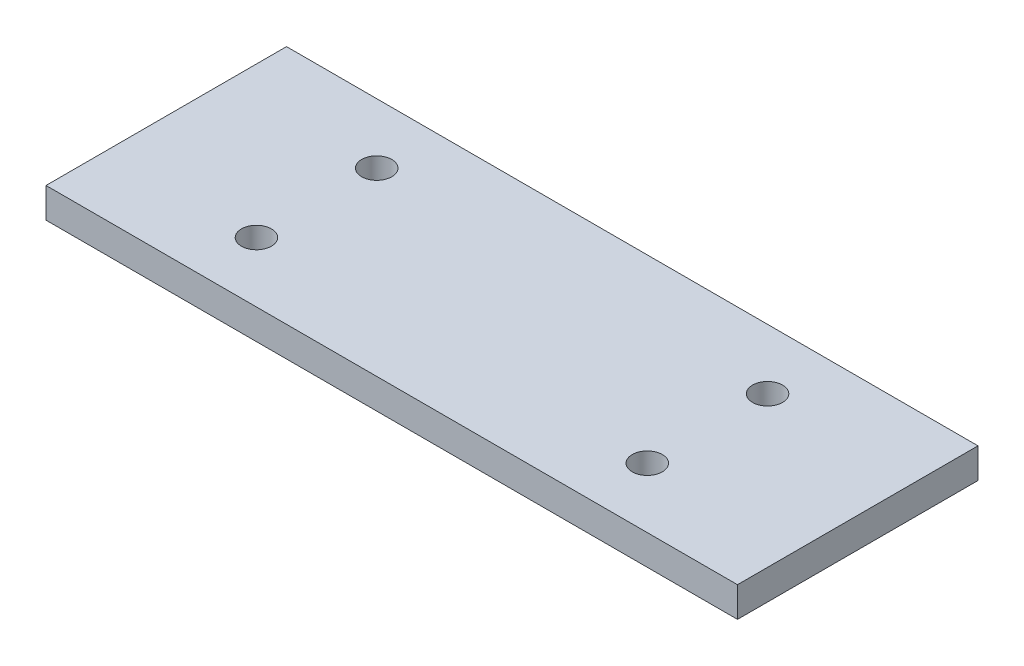
ISO-10303-21;
HEADER;
FILE_DESCRIPTION(('STEP AP214'),'2;1');
FILE_NAME('part.step','',(''),(''),'','','');
FILE_SCHEMA(('AUTOMOTIVE_DESIGN { 1 0 10303 214 1 1 1 1 }'));
ENDSEC;
DATA;
#1=APPLICATION_CONTEXT('core data for automotive mechanical design processes');
#2=APPLICATION_PROTOCOL_DEFINITION('international standard','automotive_design',2000,#1);
#3=PRODUCT_CONTEXT('',#1,'mechanical');
#4=PRODUCT('Part','Part','',(#3));
#5=PRODUCT_RELATED_PRODUCT_CATEGORY('part','',(#4));
#6=PRODUCT_DEFINITION_FORMATION('','',#4);
#7=PRODUCT_DEFINITION_CONTEXT('part definition',#1,'design');
#8=PRODUCT_DEFINITION('design','',#6,#7);
#9=PRODUCT_DEFINITION_SHAPE('','',#8);
#10=(LENGTH_UNIT() NAMED_UNIT(*) SI_UNIT(.MILLI.,.METRE.));
#11=(NAMED_UNIT(*) PLANE_ANGLE_UNIT() SI_UNIT($,.RADIAN.));
#12=(NAMED_UNIT(*) SI_UNIT($,.STERADIAN.) SOLID_ANGLE_UNIT());
#13=UNCERTAINTY_MEASURE_WITH_UNIT(LENGTH_MEASURE(1.E-05),#10,'distance_accuracy_value','');
#14=(GEOMETRIC_REPRESENTATION_CONTEXT(3) GLOBAL_UNCERTAINTY_ASSIGNED_CONTEXT((#13)) GLOBAL_UNIT_ASSIGNED_CONTEXT((#10,
#11,#12)) REPRESENTATION_CONTEXT('',''));
#15=CARTESIAN_POINT('',(0.,0.,0.));
#16=DIRECTION('',(0.,0.,1.));
#17=DIRECTION('',(1.,0.,0.));
#18=AXIS2_PLACEMENT_3D('',#15,#16,#17);
#19=CARTESIAN_POINT('',(0.,5.,0.));
#20=DIRECTION('',(0.,-1.,0.));
#21=DIRECTION('',(0.,0.,-1.));
#22=AXIS2_PLACEMENT_3D('',#19,#20,#21);
#23=PLANE('',#22);
#24=DIRECTION('',(0.,0.,1.));
#25=VECTOR('',#24,1.);
#26=CARTESIAN_POINT('',(0.,5.,0.));
#27=LINE('',#26,#25);
#28=CARTESIAN_POINT('',(0.,5.,-40.));
#29=VERTEX_POINT('',#28);
#30=CARTESIAN_POINT('',(0.,5.,0.));
#31=VERTEX_POINT('',#30);
#32=EDGE_CURVE('E89',#29,#31,#27,.T.);
#33=ORIENTED_EDGE('',*,*,#32,.T.);
#34=DIRECTION('',(1.,0.,0.));
#35=VECTOR('',#34,1.);
#36=CARTESIAN_POINT('',(0.,5.,0.));
#37=LINE('',#36,#35);
#38=CARTESIAN_POINT('',(115.,5.,0.));
#39=VERTEX_POINT('',#38);
#40=EDGE_CURVE('E84',#31,#39,#37,.T.);
#41=ORIENTED_EDGE('',*,*,#40,.T.);
#42=DIRECTION('',(0.,0.,-1.));
#43=VECTOR('',#42,1.);
#44=CARTESIAN_POINT('',(115.,5.,0.));
#45=LINE('',#44,#43);
#46=CARTESIAN_POINT('',(115.,5.,-40.));
#47=VERTEX_POINT('',#46);
#48=EDGE_CURVE('E87',#39,#47,#45,.T.);
#49=ORIENTED_EDGE('',*,*,#48,.T.);
#50=DIRECTION('',(-1.,0.,0.));
#51=VECTOR('',#50,1.);
#52=CARTESIAN_POINT('',(0.,5.,-40.));
#53=LINE('',#52,#51);
#54=EDGE_CURVE('E54',#47,#29,#53,.T.);
#55=ORIENTED_EDGE('',*,*,#54,.T.);
#56=EDGE_LOOP('',(#33,#41,#49,#55));
#57=FACE_BOUND('',#56,.T.);
#58=CARTESIAN_POINT('',(25.,5.,-30.));
#59=DIRECTION('',(0.,1.,0.));
#60=DIRECTION('',(0.,0.,1.));
#61=AXIS2_PLACEMENT_3D('',#58,#59,#60);
#62=CIRCLE('',#61,2.5);
#63=CARTESIAN_POINT('',(25.,5.,-27.5));
#64=VERTEX_POINT('',#63);
#65=EDGE_CURVE('E104',#64,#64,#62,.T.);
#66=ORIENTED_EDGE('',*,*,#65,.F.);
#67=EDGE_LOOP('',(#66));
#68=FACE_BOUND('',#67,.T.);
#69=CARTESIAN_POINT('',(25.,5.,-10.));
#70=DIRECTION('',(0.,1.,0.));
#71=DIRECTION('',(0.,0.,1.));
#72=AXIS2_PLACEMENT_3D('',#69,#70,#71);
#73=CIRCLE('',#72,2.5);
#74=CARTESIAN_POINT('',(25.,5.,-7.5));
#75=VERTEX_POINT('',#74);
#76=EDGE_CURVE('E119',#75,#75,#73,.T.);
#77=ORIENTED_EDGE('',*,*,#76,.F.);
#78=EDGE_LOOP('',(#77));
#79=FACE_BOUND('',#78,.T.);
#80=CARTESIAN_POINT('',(90.,5.,-10.));
#81=DIRECTION('',(0.,1.,0.));
#82=DIRECTION('',(0.,0.,-1.));
#83=AXIS2_PLACEMENT_3D('',#80,#81,#82);
#84=CIRCLE('',#83,2.5);
#85=CARTESIAN_POINT('',(90.,5.,-12.5));
#86=VERTEX_POINT('',#85);
#87=EDGE_CURVE('E125',#86,#86,#84,.T.);
#88=ORIENTED_EDGE('',*,*,#87,.F.);
#89=EDGE_LOOP('',(#88));
#90=FACE_BOUND('',#89,.T.);
#91=CARTESIAN_POINT('',(90.,5.,-30.));
#92=DIRECTION('',(0.,1.,0.));
#93=DIRECTION('',(0.,0.,-1.));
#94=AXIS2_PLACEMENT_3D('',#91,#92,#93);
#95=CIRCLE('',#94,2.49999999999999);
#96=CARTESIAN_POINT('',(90.,5.,-32.5));
#97=VERTEX_POINT('',#96);
#98=EDGE_CURVE('E131',#97,#97,#95,.T.);
#99=ORIENTED_EDGE('',*,*,#98,.F.);
#100=EDGE_LOOP('',(#99));
#101=FACE_BOUND('',#100,.T.);
#102=ADVANCED_FACE('F37',(#57,#68,#79,#90,#101),#23,.F.);
#103=CARTESIAN_POINT('',(0.,0.,0.));
#104=DIRECTION('',(0.,-1.,0.));
#105=DIRECTION('',(0.,0.,-1.));
#106=AXIS2_PLACEMENT_3D('',#103,#104,#105);
#107=PLANE('',#106);
#108=CARTESIAN_POINT('',(90.,0.,-10.));
#109=DIRECTION('',(0.,1.,0.));
#110=DIRECTION('',(0.,0.,-1.));
#111=AXIS2_PLACEMENT_3D('',#108,#109,#110);
#112=CIRCLE('',#111,2.5);
#113=CARTESIAN_POINT('',(90.,0.,-12.5));
#114=VERTEX_POINT('',#113);
#115=EDGE_CURVE('E128',#114,#114,#112,.T.);
#116=ORIENTED_EDGE('',*,*,#115,.T.);
#117=EDGE_LOOP('',(#116));
#118=FACE_BOUND('',#117,.T.);
#119=CARTESIAN_POINT('',(25.,0.,-30.));
#120=DIRECTION('',(0.,1.,0.));
#121=DIRECTION('',(0.,0.,1.));
#122=AXIS2_PLACEMENT_3D('',#119,#120,#121);
#123=CIRCLE('',#122,2.5);
#124=CARTESIAN_POINT('',(25.,0.,-27.5));
#125=VERTEX_POINT('',#124);
#126=EDGE_CURVE('E116',#125,#125,#123,.T.);
#127=ORIENTED_EDGE('',*,*,#126,.T.);
#128=EDGE_LOOP('',(#127));
#129=FACE_BOUND('',#128,.T.);
#130=DIRECTION('',(0.,0.,1.));
#131=VECTOR('',#130,1.);
#132=CARTESIAN_POINT('',(0.,0.,0.));
#133=LINE('',#132,#131);
#134=CARTESIAN_POINT('',(0.,0.,-40.));
#135=VERTEX_POINT('',#134);
#136=CARTESIAN_POINT('',(0.,0.,0.));
#137=VERTEX_POINT('',#136);
#138=EDGE_CURVE('E101',#135,#137,#133,.T.);
#139=ORIENTED_EDGE('',*,*,#138,.F.);
#140=DIRECTION('',(-1.,0.,0.));
#141=VECTOR('',#140,1.);
#142=CARTESIAN_POINT('',(0.,0.,-40.));
#143=LINE('',#142,#141);
#144=CARTESIAN_POINT('',(115.,0.,-40.));
#145=VERTEX_POINT('',#144);
#146=EDGE_CURVE('E77',#145,#135,#143,.T.);
#147=ORIENTED_EDGE('',*,*,#146,.F.);
#148=DIRECTION('',(0.,0.,-1.));
#149=VECTOR('',#148,1.);
#150=CARTESIAN_POINT('',(115.,0.,0.));
#151=LINE('',#150,#149);
#152=CARTESIAN_POINT('',(115.,0.,0.));
#153=VERTEX_POINT('',#152);
#154=EDGE_CURVE('E71',#153,#145,#151,.T.);
#155=ORIENTED_EDGE('',*,*,#154,.F.);
#156=DIRECTION('',(1.,0.,0.));
#157=VECTOR('',#156,1.);
#158=CARTESIAN_POINT('',(0.,0.,0.));
#159=LINE('',#158,#157);
#160=EDGE_CURVE('E93',#137,#153,#159,.T.);
#161=ORIENTED_EDGE('',*,*,#160,.F.);
#162=EDGE_LOOP('',(#139,#147,#155,#161));
#163=FACE_BOUND('',#162,.T.);
#164=CARTESIAN_POINT('',(25.,0.,-10.));
#165=DIRECTION('',(0.,1.,0.));
#166=DIRECTION('',(0.,0.,1.));
#167=AXIS2_PLACEMENT_3D('',#164,#165,#166);
#168=CIRCLE('',#167,2.5);
#169=CARTESIAN_POINT('',(25.,0.,-7.5));
#170=VERTEX_POINT('',#169);
#171=EDGE_CURVE('E122',#170,#170,#168,.T.);
#172=ORIENTED_EDGE('',*,*,#171,.T.);
#173=EDGE_LOOP('',(#172));
#174=FACE_BOUND('',#173,.T.);
#175=CARTESIAN_POINT('',(90.,0.,-30.));
#176=DIRECTION('',(0.,1.,0.));
#177=DIRECTION('',(0.,0.,-1.));
#178=AXIS2_PLACEMENT_3D('',#175,#176,#177);
#179=CIRCLE('',#178,2.49999999999999);
#180=CARTESIAN_POINT('',(90.,0.,-32.5));
#181=VERTEX_POINT('',#180);
#182=EDGE_CURVE('E134',#181,#181,#179,.T.);
#183=ORIENTED_EDGE('',*,*,#182,.T.);
#184=EDGE_LOOP('',(#183));
#185=FACE_BOUND('',#184,.T.);
#186=ADVANCED_FACE('F112',(#118,#129,#163,#174,#185),#107,.T.);
#187=CARTESIAN_POINT('',(0.,5.,0.));
#188=DIRECTION('',(1.,0.,0.));
#189=DIRECTION('',(0.,0.,-1.));
#190=AXIS2_PLACEMENT_3D('',#187,#188,#189);
#191=PLANE('',#190);
#192=ORIENTED_EDGE('',*,*,#138,.T.);
#193=DIRECTION('',(0.,-1.,0.));
#194=VECTOR('',#193,1.);
#195=CARTESIAN_POINT('',(0.,5.,0.));
#196=LINE('',#195,#194);
#197=EDGE_CURVE('E11',#31,#137,#196,.T.);
#198=ORIENTED_EDGE('',*,*,#197,.F.);
#199=ORIENTED_EDGE('',*,*,#32,.F.);
#200=DIRECTION('',(0.,-1.,0.));
#201=VECTOR('',#200,1.);
#202=CARTESIAN_POINT('',(0.,5.,-40.));
#203=LINE('',#202,#201);
#204=EDGE_CURVE('E97',#29,#135,#203,.T.);
#205=ORIENTED_EDGE('',*,*,#204,.T.);
#206=EDGE_LOOP('',(#192,#198,#199,#205));
#207=FACE_BOUND('',#206,.T.);
#208=ADVANCED_FACE('F39',(#207),#191,.F.);
#209=CARTESIAN_POINT('',(0.,5.,0.));
#210=DIRECTION('',(0.,0.,-1.));
#211=DIRECTION('',(-1.,0.,0.));
#212=AXIS2_PLACEMENT_3D('',#209,#210,#211);
#213=PLANE('',#212);
#214=ORIENTED_EDGE('',*,*,#160,.T.);
#215=DIRECTION('',(0.,-1.,0.));
#216=VECTOR('',#215,1.);
#217=CARTESIAN_POINT('',(115.,5.,0.));
#218=LINE('',#217,#216);
#219=EDGE_CURVE('E46',#39,#153,#218,.T.);
#220=ORIENTED_EDGE('',*,*,#219,.F.);
#221=ORIENTED_EDGE('',*,*,#40,.F.);
#222=ORIENTED_EDGE('',*,*,#197,.T.);
#223=EDGE_LOOP('',(#214,#220,#221,#222));
#224=FACE_BOUND('',#223,.T.);
#225=ADVANCED_FACE('F92',(#224),#213,.F.);
#226=CARTESIAN_POINT('',(115.,5.,0.));
#227=DIRECTION('',(-1.,0.,0.));
#228=DIRECTION('',(0.,0.,1.));
#229=AXIS2_PLACEMENT_3D('',#226,#227,#228);
#230=PLANE('',#229);
#231=ORIENTED_EDGE('',*,*,#154,.T.);
#232=DIRECTION('',(0.,-1.,0.));
#233=VECTOR('',#232,1.);
#234=CARTESIAN_POINT('',(115.,5.,-40.));
#235=LINE('',#234,#233);
#236=EDGE_CURVE('E94',#47,#145,#235,.T.);
#237=ORIENTED_EDGE('',*,*,#236,.F.);
#238=ORIENTED_EDGE('',*,*,#48,.F.);
#239=ORIENTED_EDGE('',*,*,#219,.T.);
#240=EDGE_LOOP('',(#231,#237,#238,#239));
#241=FACE_BOUND('',#240,.T.);
#242=ADVANCED_FACE('F95',(#241),#230,.F.);
#243=CARTESIAN_POINT('',(0.,5.,-40.));
#244=DIRECTION('',(0.,0.,1.));
#245=DIRECTION('',(1.,0.,0.));
#246=AXIS2_PLACEMENT_3D('',#243,#244,#245);
#247=PLANE('',#246);
#248=ORIENTED_EDGE('',*,*,#146,.T.);
#249=ORIENTED_EDGE('',*,*,#204,.F.);
#250=ORIENTED_EDGE('',*,*,#54,.F.);
#251=ORIENTED_EDGE('',*,*,#236,.T.);
#252=EDGE_LOOP('',(#248,#249,#250,#251));
#253=FACE_BOUND('',#252,.T.);
#254=ADVANCED_FACE('F109',(#253),#247,.F.);
#255=CARTESIAN_POINT('',(25.,5.,-30.));
#256=DIRECTION('',(0.,-1.,0.));
#257=DIRECTION('',(0.,0.,-1.));
#258=AXIS2_PLACEMENT_3D('',#255,#256,#257);
#259=CYLINDRICAL_SURFACE('',#258,2.5);
#260=ORIENTED_EDGE('',*,*,#65,.T.);
#261=EDGE_LOOP('',(#260));
#262=FACE_BOUND('',#261,.T.);
#263=ORIENTED_EDGE('',*,*,#126,.F.);
#264=EDGE_LOOP('',(#263));
#265=FACE_BOUND('',#264,.T.);
#266=ADVANCED_FACE('F151',(#262,#265),#259,.F.);
#267=CARTESIAN_POINT('',(25.,5.,-10.));
#268=DIRECTION('',(0.,-1.,0.));
#269=DIRECTION('',(0.,0.,-1.));
#270=AXIS2_PLACEMENT_3D('',#267,#268,#269);
#271=CYLINDRICAL_SURFACE('',#270,2.5);
#272=ORIENTED_EDGE('',*,*,#76,.T.);
#273=EDGE_LOOP('',(#272));
#274=FACE_BOUND('',#273,.T.);
#275=ORIENTED_EDGE('',*,*,#171,.F.);
#276=EDGE_LOOP('',(#275));
#277=FACE_BOUND('',#276,.T.);
#278=ADVANCED_FACE('F205',(#274,#277),#271,.F.);
#279=CARTESIAN_POINT('',(90.,5.,-10.));
#280=DIRECTION('',(0.,-1.,0.));
#281=DIRECTION('',(0.,0.,-1.));
#282=AXIS2_PLACEMENT_3D('',#279,#280,#281);
#283=CYLINDRICAL_SURFACE('',#282,2.5);
#284=ORIENTED_EDGE('',*,*,#87,.T.);
#285=EDGE_LOOP('',(#284));
#286=FACE_BOUND('',#285,.T.);
#287=ORIENTED_EDGE('',*,*,#115,.F.);
#288=EDGE_LOOP('',(#287));
#289=FACE_BOUND('',#288,.T.);
#290=ADVANCED_FACE('F214',(#286,#289),#283,.F.);
#291=CARTESIAN_POINT('',(90.,5.,-30.));
#292=DIRECTION('',(0.,-1.,0.));
#293=DIRECTION('',(0.,0.,-1.));
#294=AXIS2_PLACEMENT_3D('',#291,#292,#293);
#295=CYLINDRICAL_SURFACE('',#294,2.49999999999999);
#296=ORIENTED_EDGE('',*,*,#98,.T.);
#297=EDGE_LOOP('',(#296));
#298=FACE_BOUND('',#297,.T.);
#299=ORIENTED_EDGE('',*,*,#182,.F.);
#300=EDGE_LOOP('',(#299));
#301=FACE_BOUND('',#300,.T.);
#302=ADVANCED_FACE('F140',(#298,#301),#295,.F.);
#303=CLOSED_SHELL('',(#102,#186,#208,#225,#242,#254,#266,#278,#290,#302));
#304=MANIFOLD_SOLID_BREP('B2',#303);
#305=ADVANCED_BREP_SHAPE_REPRESENTATION('',(#18,#304),#14);
#306=SHAPE_DEFINITION_REPRESENTATION(#9,#305);
ENDSEC;
END-ISO-10303-21;
